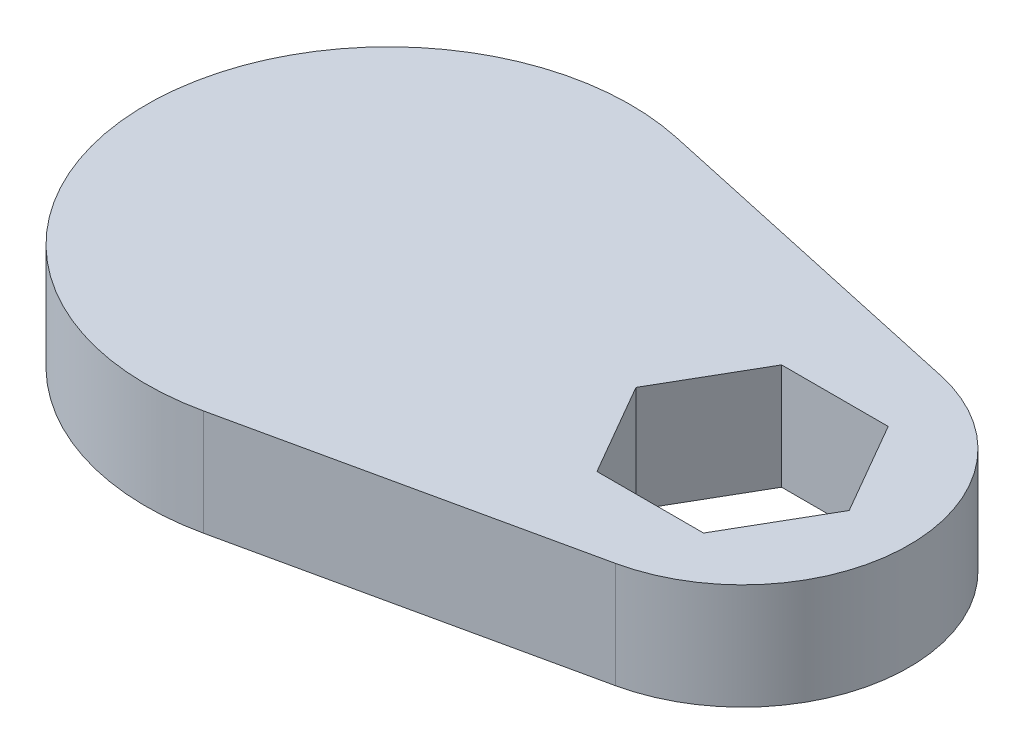
ISO-10303-21;
HEADER;
FILE_DESCRIPTION(('STEP AP214'),'2;1');
FILE_NAME('part.step','',(''),(''),'','','');
FILE_SCHEMA(('AUTOMOTIVE_DESIGN { 1 0 10303 214 1 1 1 1 }'));
ENDSEC;
DATA;
#1=APPLICATION_CONTEXT('core data for automotive mechanical design processes');
#2=APPLICATION_PROTOCOL_DEFINITION('international standard','automotive_design',2000,#1);
#3=PRODUCT_CONTEXT('',#1,'mechanical');
#4=PRODUCT('Part','Part','',(#3));
#5=PRODUCT_RELATED_PRODUCT_CATEGORY('part','',(#4));
#6=PRODUCT_DEFINITION_FORMATION('','',#4);
#7=PRODUCT_DEFINITION_CONTEXT('part definition',#1,'design');
#8=PRODUCT_DEFINITION('design','',#6,#7);
#9=PRODUCT_DEFINITION_SHAPE('','',#8);
#10=(LENGTH_UNIT() NAMED_UNIT(*) SI_UNIT(.MILLI.,.METRE.));
#11=(NAMED_UNIT(*) PLANE_ANGLE_UNIT() SI_UNIT($,.RADIAN.));
#12=(NAMED_UNIT(*) SI_UNIT($,.STERADIAN.) SOLID_ANGLE_UNIT());
#13=UNCERTAINTY_MEASURE_WITH_UNIT(LENGTH_MEASURE(1.E-05),#10,'distance_accuracy_value','');
#14=(GEOMETRIC_REPRESENTATION_CONTEXT(3) GLOBAL_UNCERTAINTY_ASSIGNED_CONTEXT((#13)) GLOBAL_UNIT_ASSIGNED_CONTEXT((#10,
#11,#12)) REPRESENTATION_CONTEXT('',''));
#15=CARTESIAN_POINT('',(0.,0.,0.));
#16=DIRECTION('',(0.,0.,1.));
#17=DIRECTION('',(1.,0.,0.));
#18=AXIS2_PLACEMENT_3D('',#15,#16,#17);
#19=CARTESIAN_POINT('',(14.0577549630851,7.,8.11624861213897));
#20=DIRECTION('',(-0.866025403784439,0.,-0.5));
#21=DIRECTION('',(-0.5,0.,0.866025403784439));
#22=AXIS2_PLACEMENT_3D('',#19,#20,#21);
#23=PLANE('',#22);
#24=DIRECTION('',(0.5,0.,-0.866025403784439));
#25=VECTOR('',#24,1.);
#26=CARTESIAN_POINT('',(14.0577549630851,0.,8.11624861213897));
#27=LINE('',#26,#25);
#28=CARTESIAN_POINT('',(15.2218366420567,0.,6.09999999999999));
#29=VERTEX_POINT('',#28);
#30=CARTESIAN_POINT('',(18.7436732841134,0.,0.));
#31=VERTEX_POINT('',#30);
#32=EDGE_CURVE('E159',#29,#31,#27,.T.);
#33=ORIENTED_EDGE('',*,*,#32,.F.);
#34=DIRECTION('',(0.,-1.,0.));
#35=VECTOR('',#34,1.);
#36=CARTESIAN_POINT('',(15.2218366420567,7.,6.09999999999999));
#37=LINE('',#36,#35);
#38=CARTESIAN_POINT('',(15.2218366420567,7.,6.09999999999999));
#39=VERTEX_POINT('',#38);
#40=EDGE_CURVE('E11',#39,#29,#37,.T.);
#41=ORIENTED_EDGE('',*,*,#40,.F.);
#42=DIRECTION('',(0.5,0.,-0.866025403784439));
#43=VECTOR('',#42,1.);
#44=CARTESIAN_POINT('',(14.0577549630851,7.,8.11624861213897));
#45=LINE('',#44,#43);
#46=CARTESIAN_POINT('',(18.7436732841134,7.,0.));
#47=VERTEX_POINT('',#46);
#48=EDGE_CURVE('E203',#39,#47,#45,.T.);
#49=ORIENTED_EDGE('',*,*,#48,.T.);
#50=DIRECTION('',(0.,-1.,0.));
#51=VECTOR('',#50,1.);
#52=CARTESIAN_POINT('',(18.7436732841134,7.,0.));
#53=LINE('',#52,#51);
#54=EDGE_CURVE('E52',#47,#31,#53,.T.);
#55=ORIENTED_EDGE('',*,*,#54,.T.);
#56=EDGE_LOOP('',(#33,#41,#49,#55));
#57=FACE_BOUND('',#56,.T.);
#58=ADVANCED_FACE('F33',(#57),#23,.T.);
#59=CARTESIAN_POINT('',(0.,7.,6.09999999999999));
#60=DIRECTION('',(0.,0.,-1.));
#61=DIRECTION('',(-1.,0.,0.));
#62=AXIS2_PLACEMENT_3D('',#59,#60,#61);
#63=PLANE('',#62);
#64=DIRECTION('',(1.,0.,0.));
#65=VECTOR('',#64,1.);
#66=CARTESIAN_POINT('',(0.,0.,6.09999999999999));
#67=LINE('',#66,#65);
#68=CARTESIAN_POINT('',(8.17816335794329,0.,6.09999999999999));
#69=VERTEX_POINT('',#68);
#70=EDGE_CURVE('E161',#69,#29,#67,.T.);
#71=ORIENTED_EDGE('',*,*,#70,.F.);
#72=DIRECTION('',(0.,-1.,0.));
#73=VECTOR('',#72,1.);
#74=CARTESIAN_POINT('',(8.17816335794329,7.,6.09999999999999));
#75=LINE('',#74,#73);
#76=CARTESIAN_POINT('',(8.17816335794329,7.,6.09999999999999));
#77=VERTEX_POINT('',#76);
#78=EDGE_CURVE('E43',#77,#69,#75,.T.);
#79=ORIENTED_EDGE('',*,*,#78,.F.);
#80=DIRECTION('',(1.,0.,0.));
#81=VECTOR('',#80,1.);
#82=CARTESIAN_POINT('',(0.,7.,6.09999999999999));
#83=LINE('',#82,#81);
#84=EDGE_CURVE('E205',#77,#39,#83,.T.);
#85=ORIENTED_EDGE('',*,*,#84,.T.);
#86=ORIENTED_EDGE('',*,*,#40,.T.);
#87=EDGE_LOOP('',(#71,#79,#85,#86));
#88=FACE_BOUND('',#87,.T.);
#89=ADVANCED_FACE('F227',(#88),#63,.T.);
#90=CARTESIAN_POINT('',(3.49224503691493,7.,-2.01624861213897));
#91=DIRECTION('',(0.866025403784439,0.,-0.5));
#92=DIRECTION('',(-0.5,0.,-0.866025403784439));
#93=AXIS2_PLACEMENT_3D('',#90,#91,#92);
#94=PLANE('',#93);
#95=DIRECTION('',(0.5,0.,0.866025403784439));
#96=VECTOR('',#95,1.);
#97=CARTESIAN_POINT('',(3.49224503691493,0.,-2.01624861213897));
#98=LINE('',#97,#96);
#99=CARTESIAN_POINT('',(4.65632671588657,0.,0.));
#100=VERTEX_POINT('',#99);
#101=EDGE_CURVE('E164',#100,#69,#98,.T.);
#102=ORIENTED_EDGE('',*,*,#101,.F.);
#103=DIRECTION('',(0.,-1.,0.));
#104=VECTOR('',#103,1.);
#105=CARTESIAN_POINT('',(4.65632671588657,7.,0.));
#106=LINE('',#105,#104);
#107=CARTESIAN_POINT('',(4.65632671588657,7.,0.));
#108=VERTEX_POINT('',#107);
#109=EDGE_CURVE('E126',#108,#100,#106,.T.);
#110=ORIENTED_EDGE('',*,*,#109,.F.);
#111=DIRECTION('',(0.5,0.,0.866025403784439));
#112=VECTOR('',#111,1.);
#113=CARTESIAN_POINT('',(3.49224503691493,7.,-2.01624861213897));
#114=LINE('',#113,#112);
#115=EDGE_CURVE('E137',#108,#77,#114,.T.);
#116=ORIENTED_EDGE('',*,*,#115,.T.);
#117=ORIENTED_EDGE('',*,*,#78,.T.);
#118=EDGE_LOOP('',(#102,#110,#116,#117));
#119=FACE_BOUND('',#118,.T.);
#120=ADVANCED_FACE('F213',(#119),#94,.T.);
#121=CARTESIAN_POINT('',(3.49224503691492,7.,2.01624861213897));
#122=DIRECTION('',(0.866025403784439,0.,0.5));
#123=DIRECTION('',(0.5,0.,-0.866025403784439));
#124=AXIS2_PLACEMENT_3D('',#121,#122,#123);
#125=PLANE('',#124);
#126=DIRECTION('',(-0.5,0.,0.866025403784439));
#127=VECTOR('',#126,1.);
#128=CARTESIAN_POINT('',(3.49224503691492,0.,2.01624861213897));
#129=LINE('',#128,#127);
#130=CARTESIAN_POINT('',(8.17816335794328,0.,-6.1));
#131=VERTEX_POINT('',#130);
#132=EDGE_CURVE('E122',#131,#100,#129,.T.);
#133=ORIENTED_EDGE('',*,*,#132,.F.);
#134=DIRECTION('',(0.,-1.,0.));
#135=VECTOR('',#134,1.);
#136=CARTESIAN_POINT('',(8.17816335794328,7.,-6.1));
#137=LINE('',#136,#135);
#138=CARTESIAN_POINT('',(8.17816335794328,7.,-6.1));
#139=VERTEX_POINT('',#138);
#140=EDGE_CURVE('E117',#139,#131,#137,.T.);
#141=ORIENTED_EDGE('',*,*,#140,.F.);
#142=DIRECTION('',(-0.5,0.,0.866025403784439));
#143=VECTOR('',#142,1.);
#144=CARTESIAN_POINT('',(3.49224503691492,7.,2.01624861213897));
#145=LINE('',#144,#143);
#146=EDGE_CURVE('E120',#139,#108,#145,.T.);
#147=ORIENTED_EDGE('',*,*,#146,.T.);
#148=ORIENTED_EDGE('',*,*,#109,.T.);
#149=EDGE_LOOP('',(#133,#141,#147,#148));
#150=FACE_BOUND('',#149,.T.);
#151=ADVANCED_FACE('F119',(#150),#125,.T.);
#152=CARTESIAN_POINT('',(0.,7.,-6.1));
#153=DIRECTION('',(0.,0.,1.));
#154=DIRECTION('',(1.,0.,0.));
#155=AXIS2_PLACEMENT_3D('',#152,#153,#154);
#156=PLANE('',#155);
#157=DIRECTION('',(-1.,0.,0.));
#158=VECTOR('',#157,1.);
#159=CARTESIAN_POINT('',(0.,0.,-6.1));
#160=LINE('',#159,#158);
#161=CARTESIAN_POINT('',(15.2218366420567,0.,-6.09999999999999));
#162=VERTEX_POINT('',#161);
#163=EDGE_CURVE('E168',#162,#131,#160,.T.);
#164=ORIENTED_EDGE('',*,*,#163,.F.);
#165=DIRECTION('',(0.,-1.,0.));
#166=VECTOR('',#165,1.);
#167=CARTESIAN_POINT('',(15.2218366420567,7.,-6.09999999999999));
#168=LINE('',#167,#166);
#169=CARTESIAN_POINT('',(15.2218366420567,7.,-6.09999999999999));
#170=VERTEX_POINT('',#169);
#171=EDGE_CURVE('E83',#170,#162,#168,.T.);
#172=ORIENTED_EDGE('',*,*,#171,.F.);
#173=DIRECTION('',(-1.,0.,0.));
#174=VECTOR('',#173,1.);
#175=CARTESIAN_POINT('',(0.,7.,-6.1));
#176=LINE('',#175,#174);
#177=EDGE_CURVE('E134',#170,#139,#176,.T.);
#178=ORIENTED_EDGE('',*,*,#177,.T.);
#179=ORIENTED_EDGE('',*,*,#140,.T.);
#180=EDGE_LOOP('',(#164,#172,#178,#179));
#181=FACE_BOUND('',#180,.T.);
#182=ADVANCED_FACE('F139',(#181),#156,.T.);
#183=CARTESIAN_POINT('',(11.7,7.,0.));
#184=DIRECTION('',(0.,-1.,0.));
#185=DIRECTION('',(0.,0.,-1.));
#186=AXIS2_PLACEMENT_3D('',#183,#184,#185);
#187=CYLINDRICAL_SURFACE('',#186,11.);
#188=CARTESIAN_POINT('',(11.7,0.,0.));
#189=DIRECTION('',(0.,1.,0.));
#190=DIRECTION('',(0.,0.,1.));
#191=AXIS2_PLACEMENT_3D('',#188,#189,#190);
#192=CIRCLE('',#191,11.);
#193=CARTESIAN_POINT('',(14.0504273504273,0.,-10.7459523203094));
#194=VERTEX_POINT('',#193);
#195=CARTESIAN_POINT('',(14.0504273504274,0.,10.7459523203094));
#196=VERTEX_POINT('',#195);
#197=EDGE_CURVE('E146',#194,#196,#192,.F.);
#198=ORIENTED_EDGE('',*,*,#197,.F.);
#199=DIRECTION('',(0.,-1.,0.));
#200=VECTOR('',#199,1.);
#201=CARTESIAN_POINT('',(14.0504273504273,7.,-10.7459523203094));
#202=LINE('',#201,#200);
#203=CARTESIAN_POINT('',(14.0504273504273,7.,-10.7459523203094));
#204=VERTEX_POINT('',#203);
#205=EDGE_CURVE('E37',#204,#194,#202,.T.);
#206=ORIENTED_EDGE('',*,*,#205,.F.);
#207=CARTESIAN_POINT('',(11.7,7.,0.));
#208=DIRECTION('',(0.,1.,0.));
#209=DIRECTION('',(0.,0.,1.));
#210=AXIS2_PLACEMENT_3D('',#207,#208,#209);
#211=CIRCLE('',#210,11.);
#212=CARTESIAN_POINT('',(14.0504273504274,7.,10.7459523203094));
#213=VERTEX_POINT('',#212);
#214=EDGE_CURVE('E173',#204,#213,#211,.F.);
#215=ORIENTED_EDGE('',*,*,#214,.T.);
#216=DIRECTION('',(0.,-1.,0.));
#217=VECTOR('',#216,1.);
#218=CARTESIAN_POINT('',(14.0504273504274,7.,10.7459523203094));
#219=LINE('',#218,#217);
#220=EDGE_CURVE('E142',#213,#196,#219,.T.);
#221=ORIENTED_EDGE('',*,*,#220,.T.);
#222=EDGE_LOOP('',(#198,#206,#215,#221));
#223=FACE_BOUND('',#222,.T.);
#224=ADVANCED_FACE('F35',(#223),#187,.T.);
#225=CARTESIAN_POINT('',(2.88461538461538,7.,-13.1882142112888));
#226=DIRECTION('',(0.213675213675213,0.,-0.976904756391764));
#227=DIRECTION('',(-0.976904756391764,0.,-0.213675213675213));
#228=AXIS2_PLACEMENT_3D('',#225,#226,#227);
#229=PLANE('',#228);
#230=DIRECTION('',(0.976904756391764,0.,0.213675213675214));
#231=VECTOR('',#230,1.);
#232=CARTESIAN_POINT('',(2.88461538461538,0.,-13.1882142112888));
#233=LINE('',#232,#231);
#234=CARTESIAN_POINT('',(-8.28119658119658,0.,-15.6304761022682));
#235=VERTEX_POINT('',#234);
#236=EDGE_CURVE('E149',#235,#194,#233,.T.);
#237=ORIENTED_EDGE('',*,*,#236,.F.);
#238=DIRECTION('',(0.,-1.,0.));
#239=VECTOR('',#238,1.);
#240=CARTESIAN_POINT('',(-8.28119658119658,7.,-15.6304761022682));
#241=LINE('',#240,#239);
#242=CARTESIAN_POINT('',(-8.28119658119658,7.,-15.6304761022682));
#243=VERTEX_POINT('',#242);
#244=EDGE_CURVE('E180',#243,#235,#241,.T.);
#245=ORIENTED_EDGE('',*,*,#244,.F.);
#246=DIRECTION('',(0.976904756391764,0.,0.213675213675214));
#247=VECTOR('',#246,1.);
#248=CARTESIAN_POINT('',(2.88461538461538,7.,-13.1882142112888));
#249=LINE('',#248,#247);
#250=EDGE_CURVE('E189',#243,#204,#249,.T.);
#251=ORIENTED_EDGE('',*,*,#250,.T.);
#252=ORIENTED_EDGE('',*,*,#205,.T.);
#253=EDGE_LOOP('',(#237,#245,#251,#252));
#254=FACE_BOUND('',#253,.T.);
#255=ADVANCED_FACE('F187',(#254),#229,.T.);
#256=CARTESIAN_POINT('',(-11.7,7.,0.));
#257=DIRECTION('',(0.,-1.,0.));
#258=DIRECTION('',(0.,0.,-1.));
#259=AXIS2_PLACEMENT_3D('',#256,#257,#258);
#260=CYLINDRICAL_SURFACE('',#259,16.);
#261=CARTESIAN_POINT('',(-11.7,0.,0.));
#262=DIRECTION('',(0.,1.,0.));
#263=DIRECTION('',(0.,0.,1.));
#264=AXIS2_PLACEMENT_3D('',#261,#262,#263);
#265=CIRCLE('',#264,16.);
#266=CARTESIAN_POINT('',(-8.28119658119658,0.,15.6304761022682));
#267=VERTEX_POINT('',#266);
#268=EDGE_CURVE('E153',#235,#267,#265,.T.);
#269=ORIENTED_EDGE('',*,*,#268,.T.);
#270=DIRECTION('',(0.,-1.,0.));
#271=VECTOR('',#270,1.);
#272=CARTESIAN_POINT('',(-8.28119658119658,7.,15.6304761022682));
#273=LINE('',#272,#271);
#274=CARTESIAN_POINT('',(-8.28119658119658,7.,15.6304761022682));
#275=VERTEX_POINT('',#274);
#276=EDGE_CURVE('E179',#275,#267,#273,.T.);
#277=ORIENTED_EDGE('',*,*,#276,.F.);
#278=CARTESIAN_POINT('',(-11.7,7.,0.));
#279=DIRECTION('',(0.,1.,0.));
#280=DIRECTION('',(0.,0.,1.));
#281=AXIS2_PLACEMENT_3D('',#278,#279,#280);
#282=CIRCLE('',#281,16.);
#283=EDGE_CURVE('E197',#243,#275,#282,.T.);
#284=ORIENTED_EDGE('',*,*,#283,.F.);
#285=ORIENTED_EDGE('',*,*,#244,.T.);
#286=EDGE_LOOP('',(#269,#277,#284,#285));
#287=FACE_BOUND('',#286,.T.);
#288=ADVANCED_FACE('F195',(#287),#260,.T.);
#289=CARTESIAN_POINT('',(2.88461538461539,7.,13.1882142112888));
#290=DIRECTION('',(0.213675213675214,0.,0.976904756391764));
#291=DIRECTION('',(0.976904756391764,0.,-0.213675213675214));
#292=AXIS2_PLACEMENT_3D('',#289,#290,#291);
#293=PLANE('',#292);
#294=DIRECTION('',(-0.976904756391764,0.,0.213675213675214));
#295=VECTOR('',#294,1.);
#296=CARTESIAN_POINT('',(2.88461538461539,0.,13.1882142112888));
#297=LINE('',#296,#295);
#298=EDGE_CURVE('E156',#196,#267,#297,.T.);
#299=ORIENTED_EDGE('',*,*,#298,.F.);
#300=ORIENTED_EDGE('',*,*,#220,.F.);
#301=DIRECTION('',(-0.976904756391764,0.,0.213675213675214));
#302=VECTOR('',#301,1.);
#303=CARTESIAN_POINT('',(2.88461538461539,7.,13.1882142112888));
#304=LINE('',#303,#302);
#305=EDGE_CURVE('E200',#213,#275,#304,.T.);
#306=ORIENTED_EDGE('',*,*,#305,.T.);
#307=ORIENTED_EDGE('',*,*,#276,.T.);
#308=EDGE_LOOP('',(#299,#300,#306,#307));
#309=FACE_BOUND('',#308,.T.);
#310=ADVANCED_FACE('F201',(#309),#293,.T.);
#311=CARTESIAN_POINT('',(14.0577549630851,7.,-8.11624861213897));
#312=DIRECTION('',(-0.866025403784439,0.,0.5));
#313=DIRECTION('',(0.5,0.,0.866025403784439));
#314=AXIS2_PLACEMENT_3D('',#311,#312,#313);
#315=PLANE('',#314);
#316=DIRECTION('',(-0.5,0.,-0.866025403784439));
#317=VECTOR('',#316,1.);
#318=CARTESIAN_POINT('',(14.0577549630851,0.,-8.11624861213897));
#319=LINE('',#318,#317);
#320=EDGE_CURVE('E170',#31,#162,#319,.T.);
#321=ORIENTED_EDGE('',*,*,#320,.F.);
#322=ORIENTED_EDGE('',*,*,#54,.F.);
#323=DIRECTION('',(-0.5,0.,-0.866025403784439));
#324=VECTOR('',#323,1.);
#325=CARTESIAN_POINT('',(14.0577549630851,7.,-8.11624861213897));
#326=LINE('',#325,#324);
#327=EDGE_CURVE('E140',#47,#170,#326,.T.);
#328=ORIENTED_EDGE('',*,*,#327,.T.);
#329=ORIENTED_EDGE('',*,*,#171,.T.);
#330=EDGE_LOOP('',(#321,#322,#328,#329));
#331=FACE_BOUND('',#330,.T.);
#332=ADVANCED_FACE('F215',(#331),#315,.T.);
#333=CARTESIAN_POINT('',(0.,7.,0.));
#334=DIRECTION('',(0.,1.,0.));
#335=DIRECTION('',(0.,0.,1.));
#336=AXIS2_PLACEMENT_3D('',#333,#334,#335);
#337=PLANE('',#336);
#338=ORIENTED_EDGE('',*,*,#214,.F.);
#339=ORIENTED_EDGE('',*,*,#250,.F.);
#340=ORIENTED_EDGE('',*,*,#283,.T.);
#341=ORIENTED_EDGE('',*,*,#305,.F.);
#342=EDGE_LOOP('',(#338,#339,#340,#341));
#343=FACE_BOUND('',#342,.T.);
#344=ORIENTED_EDGE('',*,*,#48,.F.);
#345=ORIENTED_EDGE('',*,*,#84,.F.);
#346=ORIENTED_EDGE('',*,*,#115,.F.);
#347=ORIENTED_EDGE('',*,*,#146,.F.);
#348=ORIENTED_EDGE('',*,*,#177,.F.);
#349=ORIENTED_EDGE('',*,*,#327,.F.);
#350=EDGE_LOOP('',(#344,#345,#346,#347,#348,#349));
#351=FACE_BOUND('',#350,.T.);
#352=ADVANCED_FACE('F132',(#343,#351),#337,.T.);
#353=CARTESIAN_POINT('',(0.,0.,0.));
#354=DIRECTION('',(0.,1.,0.));
#355=DIRECTION('',(0.,0.,1.));
#356=AXIS2_PLACEMENT_3D('',#353,#354,#355);
#357=PLANE('',#356);
#358=CARTESIAN_POINT('',(-11.7,0.,0.));
#359=DIRECTION('',(0.,1.,0.));
#360=DIRECTION('',(0.,0.,1.));
#361=AXIS2_PLACEMENT_3D('',#358,#359,#360);
#362=CIRCLE('',#361,12.);
#363=CARTESIAN_POINT('',(-11.7,0.,12.));
#364=VERTEX_POINT('',#363);
#365=EDGE_CURVE('E325',#364,#364,#362,.T.);
#366=ORIENTED_EDGE('',*,*,#365,.T.);
#367=EDGE_LOOP('',(#366));
#368=FACE_BOUND('',#367,.T.);
#369=ORIENTED_EDGE('',*,*,#197,.T.);
#370=ORIENTED_EDGE('',*,*,#298,.T.);
#371=ORIENTED_EDGE('',*,*,#268,.F.);
#372=ORIENTED_EDGE('',*,*,#236,.T.);
#373=EDGE_LOOP('',(#369,#370,#371,#372));
#374=FACE_BOUND('',#373,.T.);
#375=ORIENTED_EDGE('',*,*,#32,.T.);
#376=ORIENTED_EDGE('',*,*,#320,.T.);
#377=ORIENTED_EDGE('',*,*,#163,.T.);
#378=ORIENTED_EDGE('',*,*,#132,.T.);
#379=ORIENTED_EDGE('',*,*,#101,.T.);
#380=ORIENTED_EDGE('',*,*,#70,.T.);
#381=EDGE_LOOP('',(#375,#376,#377,#378,#379,#380));
#382=FACE_BOUND('',#381,.T.);
#383=ADVANCED_FACE('F192',(#368,#374,#382),#357,.F.);
#384=CARTESIAN_POINT('',(-11.7,2.3,0.));
#385=DIRECTION('',(0.,-1.,0.));
#386=DIRECTION('',(0.,0.,-1.));
#387=AXIS2_PLACEMENT_3D('',#384,#385,#386);
#388=CYLINDRICAL_SURFACE('',#387,12.);
#389=CARTESIAN_POINT('',(-11.7,2.3,0.));
#390=DIRECTION('',(0.,1.,0.));
#391=DIRECTION('',(0.,0.,1.));
#392=AXIS2_PLACEMENT_3D('',#389,#390,#391);
#393=CIRCLE('',#392,12.);
#394=CARTESIAN_POINT('',(-11.7,2.3,12.));
#395=VERTEX_POINT('',#394);
#396=EDGE_CURVE('E150',#395,#395,#393,.T.);
#397=ORIENTED_EDGE('',*,*,#396,.T.);
#398=EDGE_LOOP('',(#397));
#399=FACE_BOUND('',#398,.T.);
#400=ORIENTED_EDGE('',*,*,#365,.F.);
#401=EDGE_LOOP('',(#400));
#402=FACE_BOUND('',#401,.T.);
#403=ADVANCED_FACE('F300',(#399,#402),#388,.F.);
#404=CARTESIAN_POINT('',(0.,2.3,0.));
#405=DIRECTION('',(0.,1.,0.));
#406=DIRECTION('',(0.,0.,1.));
#407=AXIS2_PLACEMENT_3D('',#404,#405,#406);
#408=PLANE('',#407);
#409=ORIENTED_EDGE('',*,*,#396,.F.);
#410=EDGE_LOOP('',(#409));
#411=FACE_BOUND('',#410,.T.);
#412=ADVANCED_FACE('F309',(#411),#408,.F.);
#413=CLOSED_SHELL('',(#58,#89,#120,#151,#182,#224,#255,#288,#310,#332,#352,#383,#403,#412));
#414=MANIFOLD_SOLID_BREP('B2',#413);
#415=ADVANCED_BREP_SHAPE_REPRESENTATION('',(#18,#414),#14);
#416=SHAPE_DEFINITION_REPRESENTATION(#9,#415);
ENDSEC;
END-ISO-10303-21;
